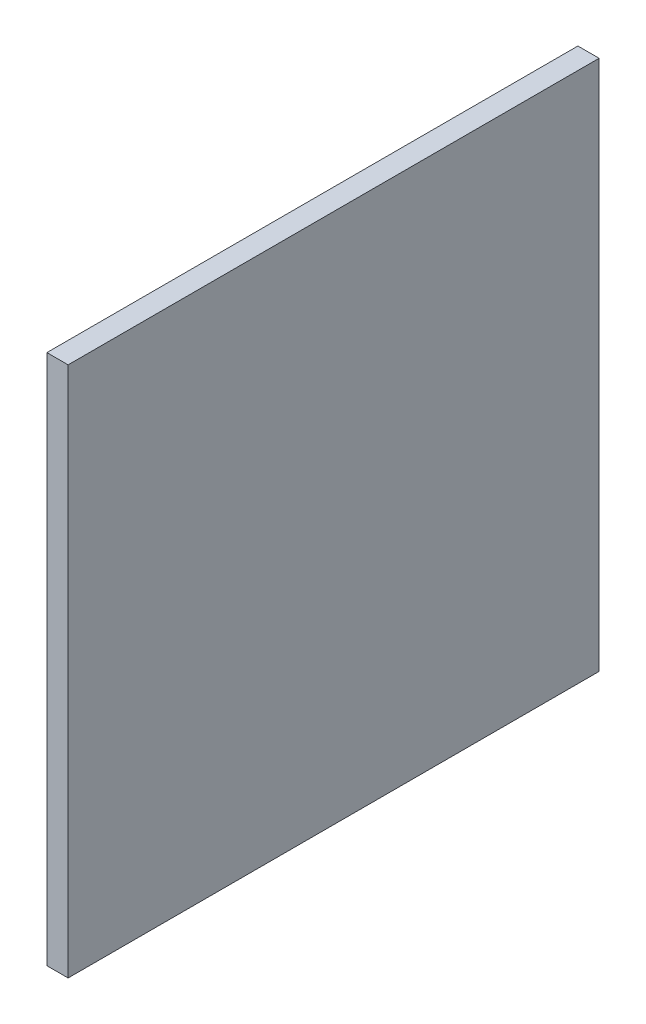
ISO-10303-21;
HEADER;
FILE_DESCRIPTION(('STEP AP214'),'2;1');
FILE_NAME('part.step','',(''),(''),'','','');
FILE_SCHEMA(('AUTOMOTIVE_DESIGN { 1 0 10303 214 1 1 1 1 }'));
ENDSEC;
DATA;
#1=APPLICATION_CONTEXT('core data for automotive mechanical design processes');
#2=APPLICATION_PROTOCOL_DEFINITION('international standard','automotive_design',2000,#1);
#3=PRODUCT_CONTEXT('',#1,'mechanical');
#4=PRODUCT('Part','Part','',(#3));
#5=PRODUCT_RELATED_PRODUCT_CATEGORY('part','',(#4));
#6=PRODUCT_DEFINITION_FORMATION('','',#4);
#7=PRODUCT_DEFINITION_CONTEXT('part definition',#1,'design');
#8=PRODUCT_DEFINITION('design','',#6,#7);
#9=PRODUCT_DEFINITION_SHAPE('','',#8);
#10=(LENGTH_UNIT() NAMED_UNIT(*) SI_UNIT(.MILLI.,.METRE.));
#11=(NAMED_UNIT(*) PLANE_ANGLE_UNIT() SI_UNIT($,.RADIAN.));
#12=(NAMED_UNIT(*) SI_UNIT($,.STERADIAN.) SOLID_ANGLE_UNIT());
#13=UNCERTAINTY_MEASURE_WITH_UNIT(LENGTH_MEASURE(1.E-05),#10,'distance_accuracy_value','');
#14=(GEOMETRIC_REPRESENTATION_CONTEXT(3) GLOBAL_UNCERTAINTY_ASSIGNED_CONTEXT((#13)) GLOBAL_UNIT_ASSIGNED_CONTEXT((#10,
#11,#12)) REPRESENTATION_CONTEXT('',''));
#15=CARTESIAN_POINT('',(0.,0.,0.));
#16=DIRECTION('',(0.,0.,1.));
#17=DIRECTION('',(1.,0.,0.));
#18=AXIS2_PLACEMENT_3D('',#15,#16,#17);
#19=CARTESIAN_POINT('',(20.,250.,250.));
#20=DIRECTION('',(0.,0.,-1.));
#21=DIRECTION('',(0.,1.,0.));
#22=AXIS2_PLACEMENT_3D('',#19,#20,#21);
#23=PLANE('',#22);
#24=DIRECTION('',(0.,-1.,0.));
#25=VECTOR('',#24,1.);
#26=CARTESIAN_POINT('',(0.,250.,250.));
#27=LINE('',#26,#25);
#28=CARTESIAN_POINT('',(0.,250.,250.));
#29=VERTEX_POINT('',#28);
#30=CARTESIAN_POINT('',(0.,-250.,250.));
#31=VERTEX_POINT('',#30);
#32=EDGE_CURVE('E97',#29,#31,#27,.T.);
#33=ORIENTED_EDGE('',*,*,#32,.T.);
#34=DIRECTION('',(-1.,0.,0.));
#35=VECTOR('',#34,1.);
#36=CARTESIAN_POINT('',(20.,-250.,250.));
#37=LINE('',#36,#35);
#38=CARTESIAN_POINT('',(20.,-250.,250.));
#39=VERTEX_POINT('',#38);
#40=EDGE_CURVE('E11',#39,#31,#37,.T.);
#41=ORIENTED_EDGE('',*,*,#40,.F.);
#42=DIRECTION('',(0.,-1.,0.));
#43=VECTOR('',#42,1.);
#44=CARTESIAN_POINT('',(20.,250.,250.));
#45=LINE('',#44,#43);
#46=CARTESIAN_POINT('',(20.,250.,250.));
#47=VERTEX_POINT('',#46);
#48=EDGE_CURVE('E85',#47,#39,#45,.T.);
#49=ORIENTED_EDGE('',*,*,#48,.F.);
#50=DIRECTION('',(-1.,0.,0.));
#51=VECTOR('',#50,1.);
#52=CARTESIAN_POINT('',(20.,250.,250.));
#53=LINE('',#52,#51);
#54=EDGE_CURVE('E93',#47,#29,#53,.T.);
#55=ORIENTED_EDGE('',*,*,#54,.T.);
#56=EDGE_LOOP('',(#33,#41,#49,#55));
#57=FACE_BOUND('',#56,.T.);
#58=ADVANCED_FACE('F34',(#57),#23,.F.);
#59=CARTESIAN_POINT('',(20.,-250.,-250.));
#60=DIRECTION('',(0.,1.,0.));
#61=DIRECTION('',(0.,0.,1.));
#62=AXIS2_PLACEMENT_3D('',#59,#60,#61);
#63=PLANE('',#62);
#64=DIRECTION('',(0.,0.,-1.));
#65=VECTOR('',#64,1.);
#66=CARTESIAN_POINT('',(0.,-250.,-250.));
#67=LINE('',#66,#65);
#68=CARTESIAN_POINT('',(0.,-250.,-250.));
#69=VERTEX_POINT('',#68);
#70=EDGE_CURVE('E89',#31,#69,#67,.T.);
#71=ORIENTED_EDGE('',*,*,#70,.T.);
#72=DIRECTION('',(-1.,0.,0.));
#73=VECTOR('',#72,1.);
#74=CARTESIAN_POINT('',(20.,-250.,-250.));
#75=LINE('',#74,#73);
#76=CARTESIAN_POINT('',(20.,-250.,-250.));
#77=VERTEX_POINT('',#76);
#78=EDGE_CURVE('E42',#77,#69,#75,.T.);
#79=ORIENTED_EDGE('',*,*,#78,.F.);
#80=DIRECTION('',(0.,0.,-1.));
#81=VECTOR('',#80,1.);
#82=CARTESIAN_POINT('',(20.,-250.,-250.));
#83=LINE('',#82,#81);
#84=EDGE_CURVE('E80',#39,#77,#83,.T.);
#85=ORIENTED_EDGE('',*,*,#84,.F.);
#86=ORIENTED_EDGE('',*,*,#40,.T.);
#87=EDGE_LOOP('',(#71,#79,#85,#86));
#88=FACE_BOUND('',#87,.T.);
#89=ADVANCED_FACE('F88',(#88),#63,.F.);
#90=CARTESIAN_POINT('',(20.,250.,-250.));
#91=DIRECTION('',(0.,0.,1.));
#92=DIRECTION('',(0.,-1.,0.));
#93=AXIS2_PLACEMENT_3D('',#90,#91,#92);
#94=PLANE('',#93);
#95=DIRECTION('',(0.,1.,0.));
#96=VECTOR('',#95,1.);
#97=CARTESIAN_POINT('',(0.,250.,-250.));
#98=LINE('',#97,#96);
#99=CARTESIAN_POINT('',(0.,250.,-250.));
#100=VERTEX_POINT('',#99);
#101=EDGE_CURVE('E67',#69,#100,#98,.T.);
#102=ORIENTED_EDGE('',*,*,#101,.T.);
#103=DIRECTION('',(-1.,0.,0.));
#104=VECTOR('',#103,1.);
#105=CARTESIAN_POINT('',(20.,250.,-250.));
#106=LINE('',#105,#104);
#107=CARTESIAN_POINT('',(20.,250.,-250.));
#108=VERTEX_POINT('',#107);
#109=EDGE_CURVE('E90',#108,#100,#106,.T.);
#110=ORIENTED_EDGE('',*,*,#109,.F.);
#111=DIRECTION('',(0.,1.,0.));
#112=VECTOR('',#111,1.);
#113=CARTESIAN_POINT('',(20.,250.,-250.));
#114=LINE('',#113,#112);
#115=EDGE_CURVE('E83',#77,#108,#114,.T.);
#116=ORIENTED_EDGE('',*,*,#115,.F.);
#117=ORIENTED_EDGE('',*,*,#78,.T.);
#118=EDGE_LOOP('',(#102,#110,#116,#117));
#119=FACE_BOUND('',#118,.T.);
#120=ADVANCED_FACE('F91',(#119),#94,.F.);
#121=CARTESIAN_POINT('',(20.,250.,-250.));
#122=DIRECTION('',(0.,-1.,0.));
#123=DIRECTION('',(0.,0.,-1.));
#124=AXIS2_PLACEMENT_3D('',#121,#122,#123);
#125=PLANE('',#124);
#126=DIRECTION('',(0.,0.,1.));
#127=VECTOR('',#126,1.);
#128=CARTESIAN_POINT('',(0.,250.,-250.));
#129=LINE('',#128,#127);
#130=EDGE_CURVE('E73',#100,#29,#129,.T.);
#131=ORIENTED_EDGE('',*,*,#130,.T.);
#132=ORIENTED_EDGE('',*,*,#54,.F.);
#133=DIRECTION('',(0.,0.,1.));
#134=VECTOR('',#133,1.);
#135=CARTESIAN_POINT('',(20.,250.,-250.));
#136=LINE('',#135,#134);
#137=EDGE_CURVE('E50',#108,#47,#136,.T.);
#138=ORIENTED_EDGE('',*,*,#137,.F.);
#139=ORIENTED_EDGE('',*,*,#109,.T.);
#140=EDGE_LOOP('',(#131,#132,#138,#139));
#141=FACE_BOUND('',#140,.T.);
#142=ADVANCED_FACE('F104',(#141),#125,.F.);
#143=CARTESIAN_POINT('',(20.,0.,0.));
#144=DIRECTION('',(-1.,0.,0.));
#145=DIRECTION('',(0.,0.,1.));
#146=AXIS2_PLACEMENT_3D('',#143,#144,#145);
#147=PLANE('',#146);
#148=ORIENTED_EDGE('',*,*,#48,.T.);
#149=ORIENTED_EDGE('',*,*,#84,.T.);
#150=ORIENTED_EDGE('',*,*,#115,.T.);
#151=ORIENTED_EDGE('',*,*,#137,.T.);
#152=EDGE_LOOP('',(#148,#149,#150,#151));
#153=FACE_BOUND('',#152,.T.);
#154=ADVANCED_FACE('F81',(#153),#147,.F.);
#155=CARTESIAN_POINT('',(0.,0.,0.));
#156=DIRECTION('',(-1.,0.,0.));
#157=DIRECTION('',(0.,0.,1.));
#158=AXIS2_PLACEMENT_3D('',#155,#156,#157);
#159=PLANE('',#158);
#160=ORIENTED_EDGE('',*,*,#32,.F.);
#161=ORIENTED_EDGE('',*,*,#130,.F.);
#162=ORIENTED_EDGE('',*,*,#101,.F.);
#163=ORIENTED_EDGE('',*,*,#70,.F.);
#164=EDGE_LOOP('',(#160,#161,#162,#163));
#165=FACE_BOUND('',#164,.T.);
#166=ADVANCED_FACE('F107',(#165),#159,.T.);
#167=CLOSED_SHELL('',(#58,#89,#120,#142,#154,#166));
#168=MANIFOLD_SOLID_BREP('B2',#167);
#169=ADVANCED_BREP_SHAPE_REPRESENTATION('',(#18,#168),#14);
#170=SHAPE_DEFINITION_REPRESENTATION(#9,#169);
ENDSEC;
END-ISO-10303-21;
